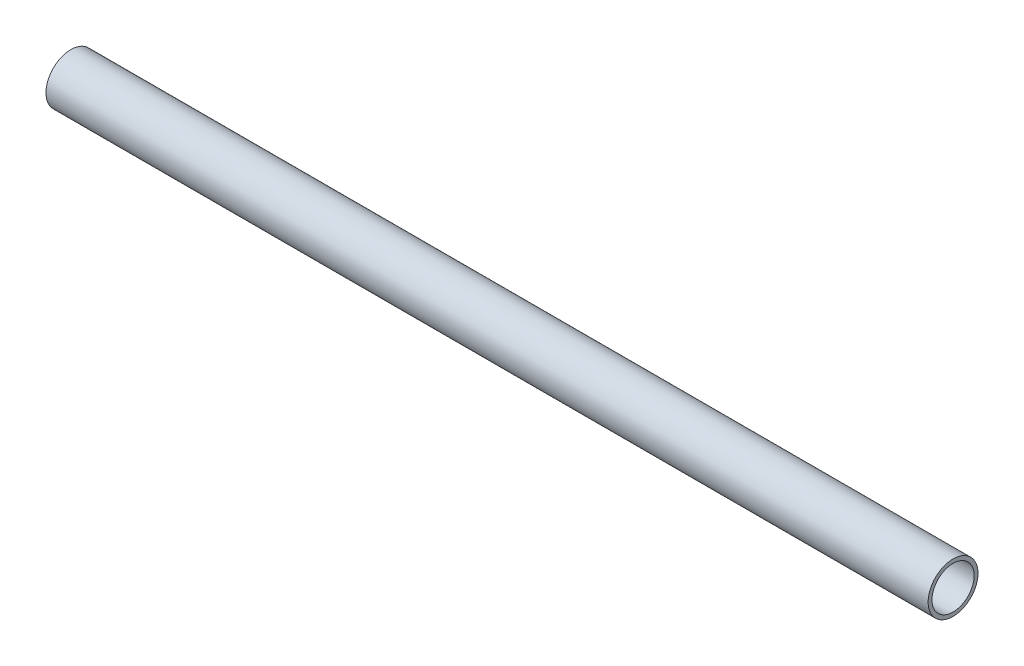
ISO-10303-21;
HEADER;
FILE_DESCRIPTION(('STEP AP214'),'2;1');
FILE_NAME('part.step','',(''),(''),'','','');
FILE_SCHEMA(('AUTOMOTIVE_DESIGN { 1 0 10303 214 1 1 1 1 }'));
ENDSEC;
DATA;
#1=APPLICATION_CONTEXT('core data for automotive mechanical design processes');
#2=APPLICATION_PROTOCOL_DEFINITION('international standard','automotive_design',2000,#1);
#3=PRODUCT_CONTEXT('',#1,'mechanical');
#4=PRODUCT('Part','Part','',(#3));
#5=PRODUCT_RELATED_PRODUCT_CATEGORY('part','',(#4));
#6=PRODUCT_DEFINITION_FORMATION('','',#4);
#7=PRODUCT_DEFINITION_CONTEXT('part definition',#1,'design');
#8=PRODUCT_DEFINITION('design','',#6,#7);
#9=PRODUCT_DEFINITION_SHAPE('','',#8);
#10=(LENGTH_UNIT() NAMED_UNIT(*) SI_UNIT(.MILLI.,.METRE.));
#11=(NAMED_UNIT(*) PLANE_ANGLE_UNIT() SI_UNIT($,.RADIAN.));
#12=(NAMED_UNIT(*) SI_UNIT($,.STERADIAN.) SOLID_ANGLE_UNIT());
#13=UNCERTAINTY_MEASURE_WITH_UNIT(LENGTH_MEASURE(1.E-05),#10,'distance_accuracy_value','');
#14=(GEOMETRIC_REPRESENTATION_CONTEXT(3) GLOBAL_UNCERTAINTY_ASSIGNED_CONTEXT((#13)) GLOBAL_UNIT_ASSIGNED_CONTEXT((#10,
#11,#12)) REPRESENTATION_CONTEXT('',''));
#15=CARTESIAN_POINT('',(0.,0.,0.));
#16=DIRECTION('',(0.,0.,1.));
#17=DIRECTION('',(1.,0.,0.));
#18=AXIS2_PLACEMENT_3D('',#15,#16,#17);
#19=CARTESIAN_POINT('',(460.,0.,0.));
#20=DIRECTION('',(1.,0.,0.));
#21=DIRECTION('',(0.,0.,-1.));
#22=AXIS2_PLACEMENT_3D('',#19,#20,#21);
#23=PLANE('',#22);
#24=CARTESIAN_POINT('',(460.,0.,0.));
#25=DIRECTION('',(1.,0.,0.));
#26=DIRECTION('',(0.,0.,-1.));
#27=AXIS2_PLACEMENT_3D('',#24,#25,#26);
#28=CIRCLE('',#27,13.);
#29=CARTESIAN_POINT('',(460.,0.,-13.));
#30=VERTEX_POINT('',#29);
#31=EDGE_CURVE('E10',#30,#30,#28,.T.);
#32=ORIENTED_EDGE('',*,*,#31,.T.);
#33=EDGE_LOOP('',(#32));
#34=FACE_BOUND('',#33,.T.);
#35=CARTESIAN_POINT('',(460.,0.,0.));
#36=DIRECTION('',(1.,0.,0.));
#37=DIRECTION('',(0.,0.,-1.));
#38=AXIS2_PLACEMENT_3D('',#35,#36,#37);
#39=CIRCLE('',#38,11.);
#40=CARTESIAN_POINT('',(460.,0.,-11.));
#41=VERTEX_POINT('',#40);
#42=EDGE_CURVE('E51',#41,#41,#39,.T.);
#43=ORIENTED_EDGE('',*,*,#42,.F.);
#44=EDGE_LOOP('',(#43));
#45=FACE_BOUND('',#44,.T.);
#46=ADVANCED_FACE('F33',(#34,#45),#23,.T.);
#47=CARTESIAN_POINT('',(0.,0.,0.));
#48=DIRECTION('',(1.,0.,0.));
#49=DIRECTION('',(0.,0.,-1.));
#50=AXIS2_PLACEMENT_3D('',#47,#48,#49);
#51=PLANE('',#50);
#52=CARTESIAN_POINT('',(0.,0.,0.));
#53=DIRECTION('',(1.,0.,0.));
#54=DIRECTION('',(0.,0.,-1.));
#55=AXIS2_PLACEMENT_3D('',#52,#53,#54);
#56=CIRCLE('',#55,13.);
#57=CARTESIAN_POINT('',(0.,0.,-13.));
#58=VERTEX_POINT('',#57);
#59=EDGE_CURVE('E46',#58,#58,#56,.T.);
#60=ORIENTED_EDGE('',*,*,#59,.F.);
#61=EDGE_LOOP('',(#60));
#62=FACE_BOUND('',#61,.T.);
#63=CARTESIAN_POINT('',(0.,0.,0.));
#64=DIRECTION('',(1.,0.,0.));
#65=DIRECTION('',(0.,0.,-1.));
#66=AXIS2_PLACEMENT_3D('',#63,#64,#65);
#67=CIRCLE('',#66,11.);
#68=CARTESIAN_POINT('',(0.,0.,-11.));
#69=VERTEX_POINT('',#68);
#70=EDGE_CURVE('E54',#69,#69,#67,.T.);
#71=ORIENTED_EDGE('',*,*,#70,.T.);
#72=EDGE_LOOP('',(#71));
#73=FACE_BOUND('',#72,.T.);
#74=ADVANCED_FACE('F86',(#62,#73),#51,.F.);
#75=CARTESIAN_POINT('',(460.,0.,0.));
#76=DIRECTION('',(-1.,0.,0.));
#77=DIRECTION('',(0.,0.,1.));
#78=AXIS2_PLACEMENT_3D('',#75,#76,#77);
#79=CYLINDRICAL_SURFACE('',#78,13.);
#80=CARTESIAN_POINT('',(447.5,0.,-13.));
#81=CARTESIAN_POINT('',(447.49999475878,0.139052660180755,-12.9999974610984));
#82=CARTESIAN_POINT('',(447.488359412702,0.27817277307216,-12.9977459806996));
#83=CARTESIAN_POINT('',(447.442158055138,0.552488133091366,-12.9889814495606));
#84=CARTESIAN_POINT('',(447.407573119314,0.6876800448946,-12.9824648818705));
#85=CARTESIAN_POINT('',(447.316574419512,0.950132537462374,-12.9658986493339));
#86=CARTESIAN_POINT('',(447.260180821726,1.07740031971374,-12.9558522492613));
#87=CARTESIAN_POINT('',(447.127223872074,1.32065723842359,-12.9333215487838));
#88=CARTESIAN_POINT('',(447.050661989214,1.43664719548843,-12.9208374259537));
#89=CARTESIAN_POINT('',(446.878520834292,1.65552432974221,-12.8946323002435));
#90=CARTESIAN_POINT('',(446.782737168549,1.75824929536754,-12.8808989548617));
#91=CARTESIAN_POINT('',(446.575310962805,1.94627668615618,-12.8538341361733));
#92=CARTESIAN_POINT('',(446.463667247923,2.03157781945353,-12.8405026927278));
#93=CARTESIAN_POINT('',(446.226536004642,2.18301679620622,-12.8156309401952));
#94=CARTESIAN_POINT('',(446.1009405689,2.24898851450227,-12.8041065326509));
#95=CARTESIAN_POINT('',(445.840190089973,2.35883220315189,-12.7843281256073));
#96=CARTESIAN_POINT('',(445.705035917458,2.4027061833528,-12.7760738286974));
#97=CARTESIAN_POINT('',(445.430743808281,2.46658610457139,-12.7638947012764));
#98=CARTESIAN_POINT('',(445.291674233303,2.48687558791543,-12.7599184822057));
#99=CARTESIAN_POINT('',(445.01205236308,2.50389090184763,-12.7565908775945));
#100=CARTESIAN_POINT('',(444.871500209056,2.50061895687195,-12.7572390554642));
#101=CARTESIAN_POINT('',(444.594964776838,2.47083395608556,-12.763040258418));
#102=CARTESIAN_POINT('',(444.458945155235,2.44464430650055,-12.7681305946622));
#103=CARTESIAN_POINT('',(444.193267016884,2.37027708135778,-12.7821440039021));
#104=CARTESIAN_POINT('',(444.063608783413,2.32209852760332,-12.7910672474073));
#105=CARTESIAN_POINT('',(443.81339305618,2.20480765459314,-12.8118060352358));
#106=CARTESIAN_POINT('',(443.692897889492,2.1355656559723,-12.8236394070727));
#107=CARTESIAN_POINT('',(443.465115028861,1.97820505089349,-12.848853471063));
#108=CARTESIAN_POINT('',(443.357828744408,1.89008443268648,-12.8622343280499));
#109=CARTESIAN_POINT('',(443.157641465779,1.6957289113267,-12.889308238097));
#110=CARTESIAN_POINT('',(443.065008809963,1.58921761155995,-12.9030027865394));
#111=CARTESIAN_POINT('',(442.898884492699,1.36202665615401,-12.9289572102898));
#112=CARTESIAN_POINT('',(442.825393042559,1.2413468441245,-12.9412170697587));
#113=CARTESIAN_POINT('',(442.69959395296,0.988957762488812,-12.9629474861032));
#114=CARTESIAN_POINT('',(442.647315265383,0.857233713043079,-12.9724142260635));
#115=CARTESIAN_POINT('',(442.565702576653,0.586650569197122,-12.9874624721642));
#116=CARTESIAN_POINT('',(442.536366009335,0.447792274642348,-12.993044412827));
#117=CARTESIAN_POINT('',(442.501846233846,0.16918991514463,-12.9996341283048));
#118=CARTESIAN_POINT('',(442.496295528159,0.0294929779953319,-13.0007114935454));
#119=CARTESIAN_POINT('',(442.508517777197,-0.248832636592813,-12.9983632998844));
#120=CARTESIAN_POINT('',(442.526289523902,-0.387461368986743,-12.994937974206));
#121=CARTESIAN_POINT('',(442.584346743995,-0.658542242580218,-12.9840126871957));
#122=CARTESIAN_POINT('',(442.624445278426,-0.79103590372499,-12.976546573136));
#123=CARTESIAN_POINT('',(442.725814780124,-1.04741955600189,-12.9583735448858));
#124=CARTESIAN_POINT('',(442.787087242297,-1.17130893891969,-12.9476664018813));
#125=CARTESIAN_POINT('',(442.929871743175,-1.40852868267245,-12.924025465347));
#126=CARTESIAN_POINT('',(443.011607091537,-1.52172218526331,-12.9110676225358));
#127=CARTESIAN_POINT('',(443.192696223497,-1.73291860543104,-12.8844225517876));
#128=CARTESIAN_POINT('',(443.292051743834,-1.83092002380894,-12.8707352520445));
#129=CARTESIAN_POINT('',(443.507228161396,-2.01035510164864,-12.8439416383922));
#130=CARTESIAN_POINT('',(443.623260250283,-2.09153739238514,-12.8308461515727));
#131=CARTESIAN_POINT('',(443.867530324273,-2.2332594883332,-12.8069410375943));
#132=CARTESIAN_POINT('',(443.995767841549,-2.29380008432375,-12.7961313228739));
#133=CARTESIAN_POINT('',(444.260186358946,-2.39216884187719,-12.7781075731774));
#134=CARTESIAN_POINT('',(444.396324133468,-2.43010977595279,-12.770875715852));
#135=CARTESIAN_POINT('',(444.673195073206,-2.48254790543447,-12.7607868732141));
#136=CARTESIAN_POINT('',(444.813927687707,-2.4970478999189,-12.7579293655635));
#137=CARTESIAN_POINT('',(445.093473355922,-2.5020951168735,-12.7569402050647));
#138=CARTESIAN_POINT('',(445.232279122967,-2.4930391021221,-12.7587302704385));
#139=CARTESIAN_POINT('',(445.506349944506,-2.45210266538043,-12.7666604796616));
#140=CARTESIAN_POINT('',(445.641615022809,-2.42022239691187,-12.7728005942514));
#141=CARTESIAN_POINT('',(445.904536619842,-2.334713477175,-12.7887053259627));
#142=CARTESIAN_POINT('',(446.032208295918,-2.28112994200391,-12.7984624206699));
#143=CARTESIAN_POINT('',(446.276812361891,-2.15377970785531,-12.8205066533974));
#144=CARTESIAN_POINT('',(446.393743938109,-2.08001148134922,-12.8327939828824));
#145=CARTESIAN_POINT('',(446.615531574685,-1.91301563814432,-12.8587559030273));
#146=CARTESIAN_POINT('',(446.720168681482,-1.81950009853849,-12.8724492796511));
#147=CARTESIAN_POINT('',(446.912397375494,-1.61626238485012,-12.8995420316146));
#148=CARTESIAN_POINT('',(446.999985042068,-1.50653649326078,-12.9129413387038));
#149=CARTESIAN_POINT('',(447.156413016856,-1.27273625734665,-12.9380865705891));
#150=CARTESIAN_POINT('',(447.225066370069,-1.14853493486942,-12.9498154901243));
#151=CARTESIAN_POINT('',(447.340420792364,-0.890172259350411,-12.9701319076699));
#152=CARTESIAN_POINT('',(447.387142167869,-0.756020253294867,-12.9787223099363));
#153=CARTESIAN_POINT('',(447.447984584215,-0.51792356570556,-12.9900734375022));
#154=CARTESIAN_POINT('',(447.467456489752,-0.415357439701686,-12.9937745900334));
#155=CARTESIAN_POINT('',(447.493465983637,-0.208540158514688,-12.9987387895389));
#156=CARTESIAN_POINT('',(447.500003930898,-0.104289050170329,-13.0000019041681));
#157=CARTESIAN_POINT('',(447.5,0.,-13.));
#158=B_SPLINE_CURVE_WITH_KNOTS('',3,(#80,#81,#82,#83,#84,#85,#86,#87,#88,#89,#90,#91,#92,#93,
#94,#95,#96,#97,#98,#99,#100,#101,#102,#103,#104,#105,#106,#107,#108,#109,#110,#111,#112,#113,
#114,#115,#116,#117,#118,#119,#120,#121,#122,#123,#124,#125,#126,#127,#128,#129,#130,#131,#132,
#133,#134,#135,#136,#137,#138,#139,#140,#141,#142,#143,#144,#145,#146,#147,#148,#149,#150,#151,
#152,#153,#154,#155,#156,#157),.UNSPECIFIED.,.T.,.F.,(4,2,2,2,2,2,2,2,2,2,2,2,2,2,2,2,2,2,2,2,2,
2,2,2,2,2,2,2,2,2,2,2,2,2,2,2,2,2,4),(0.,0.416776540572575,0.833897184796518,1.25063304157329,
1.66733855274582,2.08873532404097,2.51016332788527,2.93511361824242,3.36002525127149,
3.77977378984825,4.19948270045458,4.61336264699447,5.02726100716075,5.44376099870315,
5.86030539553688,6.28376393575659,6.70722715049961,7.13126639340051,7.55525819906336,
7.97267505699535,8.39007029508316,8.80402218494172,9.21800330627661,9.63671570954062,
10.0554694062925,10.4800902476651,10.904694820074,11.3271624654498,11.7495796603137,
12.1649281712355,12.5802738884446,12.99476059285,13.4092786732858,13.8303190431966,
14.2514561202699,14.676613602734,15.1013766593074,15.4139664054684,15.7265474772227),.UNSPECIFIED.);
#159=CARTESIAN_POINT('',(447.5,0.,-13.));
#160=VERTEX_POINT('',#159);
#161=EDGE_CURVE('E62',#160,#160,#158,.T.);
#162=ORIENTED_EDGE('',*,*,#161,.T.);
#163=EDGE_LOOP('',(#162));
#164=FACE_BOUND('',#163,.T.);
#165=CARTESIAN_POINT('',(23.,0.,-13.));
#166=CARTESIAN_POINT('',(22.9999954230033,0.111634129459772,-12.9999981798433));
#167=CARTESIAN_POINT('',(22.9906218073671,0.223332182929121,-12.9985470068655));
#168=CARTESIAN_POINT('',(22.9533858536235,0.443603799648008,-12.9928976712786));
#169=CARTESIAN_POINT('',(22.9255057350478,0.552174253226696,-12.9886968669639));
#170=CARTESIAN_POINT('',(22.8521115553316,0.762971221767027,-12.9780201450358));
#171=CARTESIAN_POINT('',(22.8066110666473,0.865202549429169,-12.9715459788835));
#172=CARTESIAN_POINT('',(22.6993014450486,1.06056417054209,-12.9570371396926));
#173=CARTESIAN_POINT('',(22.6374944879634,1.15369567594379,-12.9490026748879));
#174=CARTESIAN_POINT('',(22.49878654629,1.32899277202475,-12.9321924031196));
#175=CARTESIAN_POINT('',(22.4217781774524,1.41107292146211,-12.923411590907));
#176=CARTESIAN_POINT('',(22.2550844983716,1.56119998237499,-12.9061372591379));
#177=CARTESIAN_POINT('',(22.1653984442644,1.6292460698243,-12.8976437564756));
#178=CARTESIAN_POINT('',(21.9753182772141,1.7497082423405,-12.8818571696186));
#179=CARTESIAN_POINT('',(21.8748709307349,1.80204125030049,-12.874570554198));
#180=CARTESIAN_POINT('',(21.6664811209346,1.88906073325816,-12.8620913537326));
#181=CARTESIAN_POINT('',(21.5585390879946,1.92374822059573,-12.8568986485617));
#182=CARTESIAN_POINT('',(21.3391242090455,1.97422579132362,-12.8492445576298));
#183=CARTESIAN_POINT('',(21.2276858321148,1.99016243475776,-12.8467620000393));
#184=CARTESIAN_POINT('',(21.0036910700953,2.00314004931484,-12.8447450655813));
#185=CARTESIAN_POINT('',(20.8911347529015,2.00018216102486,-12.8452105107546));
#186=CARTESIAN_POINT('',(20.6691368963365,1.97557435962365,-12.8490176386625));
#187=CARTESIAN_POINT('',(20.5596767348901,1.9540879888833,-12.852334155509));
#188=CARTESIAN_POINT('',(20.3459339177356,1.89328929394482,-12.8614304087007));
#189=CARTESIAN_POINT('',(20.2416514155413,1.85397644155405,-12.8672102180321));
#190=CARTESIAN_POINT('',(20.040728302299,1.75847159016807,-12.8806094791762));
#191=CARTESIAN_POINT('',(19.944120994655,1.7022106216098,-12.8882364224677));
#192=CARTESIAN_POINT('',(19.7616562506645,1.57445566474822,-12.9044652207238));
#193=CARTESIAN_POINT('',(19.6757995565559,1.50296062558221,-12.9130671429243));
#194=CARTESIAN_POINT('',(19.5163256227573,1.3458707741095,-12.9303877351212));
#195=CARTESIAN_POINT('',(19.4428467859261,1.2601354172487,-12.939106680676));
#196=CARTESIAN_POINT('',(19.311299096169,1.07747683573123,-12.9555948808269));
#197=CARTESIAN_POINT('',(19.2532303172185,0.980553557370509,-12.9633641308639));
#198=CARTESIAN_POINT('',(19.1541427748092,0.778148209221874,-12.977086290908));
#199=CARTESIAN_POINT('',(19.1131350329157,0.672660659263364,-12.9830380261278));
#200=CARTESIAN_POINT('',(19.0494557432564,0.456184081690752,-12.992444828946));
#201=CARTESIAN_POINT('',(19.0267828908387,0.345195446112753,-12.9959000741847));
#202=CARTESIAN_POINT('',(19.0006018118208,0.122061413656298,-12.999900977609));
#203=CARTESIAN_POINT('',(18.9969033713341,0.00993883414831808,-13.000475512886));
#204=CARTESIAN_POINT('',(19.0082707196042,-0.213325058692731,-12.9987289757846));
#205=CARTESIAN_POINT('',(19.0233358963661,-0.324466403910715,-12.9964079978465));
#206=CARTESIAN_POINT('',(19.0716446506089,-0.542034248496511,-12.9891490837857));
#207=CARTESIAN_POINT('',(19.1047952239662,-0.64848188372896,-12.9842245404646));
#208=CARTESIAN_POINT('',(19.1882354343621,-0.854308287939675,-12.9723087739691));
#209=CARTESIAN_POINT('',(19.2385259121796,-0.953686709856466,-12.9653174494133));
#210=CARTESIAN_POINT('',(19.3552622667865,-1.14338785915144,-12.9499729976666));
#211=CARTESIAN_POINT('',(19.4218283957551,-1.23363576499287,-12.94160989393));
#212=CARTESIAN_POINT('',(19.5690595094191,-1.40174739518524,-12.9244828841827));
#213=CARTESIAN_POINT('',(19.6497253584679,-1.47961035974429,-12.9157189536244));
#214=CARTESIAN_POINT('',(19.8237143309493,-1.62143687177062,-12.8986860695372));
#215=CARTESIAN_POINT('',(19.9171421440541,-1.68527268254131,-12.8904221246483));
#216=CARTESIAN_POINT('',(20.1135063764516,-1.79634400375255,-12.8754146609527));
#217=CARTESIAN_POINT('',(20.2164425283813,-1.84357998078108,-12.8686710994129));
#218=CARTESIAN_POINT('',(20.4285258349847,-1.91991433220861,-12.8575044908204));
#219=CARTESIAN_POINT('',(20.5376486198415,-1.94907911782486,-12.8530729567255));
#220=CARTESIAN_POINT('',(20.7593170122032,-1.98865407244709,-12.8470098709954));
#221=CARTESIAN_POINT('',(20.871862369325,-1.99906561003298,-12.8453781150375));
#222=CARTESIAN_POINT('',(21.0959074702455,-2.00080471457037,-12.8451072329882));
#223=CARTESIAN_POINT('',(21.2074056683351,-1.99233317092469,-12.8464366045642));
#224=CARTESIAN_POINT('',(21.4273712100541,-1.95697794807654,-12.8518695985565));
#225=CARTESIAN_POINT('',(21.5358385595688,-1.93009430462956,-12.8559732155853));
#226=CARTESIAN_POINT('',(21.7466028412376,-1.8587503820862,-12.8664810988442));
#227=CARTESIAN_POINT('',(21.8489048745791,-1.81430487035791,-12.8728834317255));
#228=CARTESIAN_POINT('',(22.0446326689811,-1.7091189717658,-12.8872696044034));
#229=CARTESIAN_POINT('',(22.13805809795,-1.64837797557981,-12.8952535033351));
#230=CARTESIAN_POINT('',(22.3144000971441,-1.51159830040354,-12.9120041996598));
#231=CARTESIAN_POINT('',(22.3972007639687,-1.43541104590757,-12.9207781015993));
#232=CARTESIAN_POINT('',(22.5489127619627,-1.27021551598636,-12.9380614876198));
#233=CARTESIAN_POINT('',(22.6178208662629,-1.18120427010545,-12.9465709098818));
#234=CARTESIAN_POINT('',(22.7401512141118,-0.992277722296826,-12.9624232087798));
#235=CARTESIAN_POINT('',(22.7934812033924,-0.892302099536093,-12.9697590240101));
#236=CARTESIAN_POINT('',(22.8825114634284,-0.684745126818872,-12.9823684829832));
#237=CARTESIAN_POINT('',(22.918229838641,-0.577171717906743,-12.9876442432633));
#238=CARTESIAN_POINT('',(22.9629971374694,-0.390941400069085,-12.9943465728122));
#239=CARTESIAN_POINT('',(22.97685178146,-0.313429175326517,-12.9964556222015));
#240=CARTESIAN_POINT('',(22.9953547635069,-0.157288536394366,-12.9992829677305));
#241=CARTESIAN_POINT('',(23.0000032250638,-0.0786601371924729,-13.0000012825269));
#242=CARTESIAN_POINT('',(23.,0.,-13.));
#243=B_SPLINE_CURVE_WITH_KNOTS('',3,(#165,#166,#167,#168,#169,#170,#171,#172,#173,#174,#175,
#176,#177,#178,#179,#180,#181,#182,#183,#184,#185,#186,#187,#188,#189,#190,#191,#192,#193,#194,
#195,#196,#197,#198,#199,#200,#201,#202,#203,#204,#205,#206,#207,#208,#209,#210,#211,#212,#213,
#214,#215,#216,#217,#218,#219,#220,#221,#222,#223,#224,#225,#226,#227,#228,#229,#230,#231,#232,
#233,#234,#235,#236,#237,#238,#239,#240,#241,#242),.UNSPECIFIED.,.T.,.F.,(4,2,2,2,2,2,2,2,2,2,2,
2,2,2,2,2,2,2,2,2,2,2,2,2,2,2,2,2,2,2,2,2,2,2,2,2,2,2,4),(0.,0.334614935402755,
0.669551824578953,1.00423123317536,1.33886600689116,1.67595520660421,2.0130641932687,
2.35192534458354,2.69076705292646,3.02694233717947,3.36309732807123,3.69631525463016,
4.02954305496923,4.36414566185346,4.69877135746455,5.03692069824303,5.37507166226689,
5.71344073657472,6.05178573150938,6.38673217834279,6.72166770083348,7.05489683473247,
7.38814231716765,7.72392860544464,8.05973548561447,8.39848409534482,8.73722318277052,
9.07470991155935,9.41217201014686,9.74606114027123,10.0799496219993,10.4135579400877,
10.7471787342265,11.0841753844584,11.4212502200089,11.7602825362116,12.0989656022034,
12.3347466304,12.5705244955816),.UNSPECIFIED.);
#244=CARTESIAN_POINT('',(23.,0.,-13.));
#245=VERTEX_POINT('',#244);
#246=EDGE_CURVE('E61',#245,#245,#243,.T.);
#247=ORIENTED_EDGE('',*,*,#246,.T.);
#248=EDGE_LOOP('',(#247));
#249=FACE_BOUND('',#248,.T.);
#250=ORIENTED_EDGE('',*,*,#31,.F.);
#251=EDGE_LOOP('',(#250));
#252=FACE_BOUND('',#251,.T.);
#253=ORIENTED_EDGE('',*,*,#59,.T.);
#254=EDGE_LOOP('',(#253));
#255=FACE_BOUND('',#254,.T.);
#256=ADVANCED_FACE('F35',(#164,#249,#252,#255),#79,.T.);
#257=CARTESIAN_POINT('',(460.,0.,0.));
#258=DIRECTION('',(-1.,0.,0.));
#259=DIRECTION('',(0.,0.,1.));
#260=AXIS2_PLACEMENT_3D('',#257,#258,#259);
#261=CYLINDRICAL_SURFACE('',#260,11.);
#262=CARTESIAN_POINT('',(447.5,0.,-11.));
#263=CARTESIAN_POINT('',(447.499995468174,0.138518278596906,-10.9999974735185));
#264=CARTESIAN_POINT('',(447.488448772423,0.277090172258011,-10.9973570934613));
#265=CARTESIAN_POINT('',(447.442620523938,0.550288594599326,-10.987079320306));
#266=CARTESIAN_POINT('',(447.408323604045,0.684912392220731,-10.9794385496265));
#267=CARTESIAN_POINT('',(447.318131951368,0.946227671984925,-10.9600095312294));
#268=CARTESIAN_POINT('',(447.262260672019,1.07292759495649,-10.9482257885674));
#269=CARTESIAN_POINT('',(447.130582886619,1.31515227582568,-10.921778201627));
#270=CARTESIAN_POINT('',(447.054776579158,1.43067714503183,-10.9071143860398));
#271=CARTESIAN_POINT('',(446.883997955393,1.64926760444638,-10.8762265816814));
#272=CARTESIAN_POINT('',(446.788747426525,1.75211293892049,-10.8599819758326));
#273=CARTESIAN_POINT('',(446.582381025863,1.94051389816611,-10.827906511833));
#274=CARTESIAN_POINT('',(446.471263649306,2.02606788121785,-10.8120756930933));
#275=CARTESIAN_POINT('',(446.234667944716,2.17844599401788,-10.7824158369221));
#276=CARTESIAN_POINT('',(446.109033003694,2.24503254356576,-10.7686131580577));
#277=CARTESIAN_POINT('',(445.847990499418,2.35606069717871,-10.7448696147509));
#278=CARTESIAN_POINT('',(445.712584207938,2.40050517717751,-10.7349282488168));
#279=CARTESIAN_POINT('',(445.438240812883,2.4652534941272,-10.7202434469831));
#280=CARTESIAN_POINT('',(445.299400736877,2.48594892680756,-10.715415797339));
#281=CARTESIAN_POINT('',(445.020141772787,2.50382988451489,-10.7112523406768));
#282=CARTESIAN_POINT('',(444.879723097338,2.50101853886554,-10.711915802658));
#283=CARTESIAN_POINT('',(444.604227116651,2.47228016958764,-10.7185835035919));
#284=CARTESIAN_POINT('',(444.469099093805,2.44681104599439,-10.7244819412976));
#285=CARTESIAN_POINT('',(444.205085513845,2.37420684920503,-10.7407873672743));
#286=CARTESIAN_POINT('',(444.076200332373,2.3270704740429,-10.7511946264744));
#287=CARTESIAN_POINT('',(443.827059328189,2.21205734402548,-10.7754474384537));
#288=CARTESIAN_POINT('',(443.706886482236,2.14400712086012,-10.7893215597825));
#289=CARTESIAN_POINT('',(443.479497446889,1.98921977920413,-10.8189276843241));
#290=CARTESIAN_POINT('',(443.372283159736,1.9024799223714,-10.8346599596346));
#291=CARTESIAN_POINT('',(443.171221438179,1.71036518003521,-10.8666615287251));
#292=CARTESIAN_POINT('',(443.077745573484,1.60460166742831,-10.882934773515));
#293=CARTESIAN_POINT('',(442.909794111293,1.37871229840976,-10.9138502597158));
#294=CARTESIAN_POINT('',(442.835318913301,1.25858614009084,-10.9284924668293));
#295=CARTESIAN_POINT('',(442.707379612028,1.00690799179919,-10.9545497424637));
#296=CARTESIAN_POINT('',(442.653967226378,0.875328834348185,-10.9659568484873));
#297=CARTESIAN_POINT('',(442.570115994132,0.604745122491714,-10.9841998956698));
#298=CARTESIAN_POINT('',(442.539673534178,0.465741739663735,-10.9910365557784));
#299=CARTESIAN_POINT('',(442.503173762527,0.187439840192746,-10.9992650071756));
#300=CARTESIAN_POINT('',(442.496609308683,0.0482110923370514,-11.0007700184113));
#301=CARTESIAN_POINT('',(442.506673039853,-0.229353886680091,-10.9984842255063));
#302=CARTESIAN_POINT('',(442.523299519406,-0.367690182720846,-10.9946938107912));
#303=CARTESIAN_POINT('',(442.578853166905,-0.637841677218445,-10.9823148103741));
#304=CARTESIAN_POINT('',(442.617511546444,-0.76971503681441,-10.973784087055));
#305=CARTESIAN_POINT('',(442.715731027457,-1.02510393087759,-10.9528806132367));
#306=CARTESIAN_POINT('',(442.775294004253,-1.14861871432288,-10.9405075180554));
#307=CARTESIAN_POINT('',(442.914669143555,-1.38586085256054,-10.9130143275095));
#308=CARTESIAN_POINT('',(442.994775626773,-1.49941068522717,-10.8978552985532));
#309=CARTESIAN_POINT('',(443.17257932844,-1.7116377357905,-10.866546095646));
#310=CARTESIAN_POINT('',(443.270279026547,-1.81031285357969,-10.8503957821912));
#311=CARTESIAN_POINT('',(443.482830965133,-1.99201706218097,-10.8185287714487));
#312=CARTESIAN_POINT('',(443.597987241787,-2.07469366594063,-10.8028272119253));
#313=CARTESIAN_POINT('',(443.84084639067,-2.21953814406555,-10.7740023321604));
#314=CARTESIAN_POINT('',(443.96854870796,-2.28170692501019,-10.7608788979592));
#315=CARTESIAN_POINT('',(444.232180469569,-2.38333597241931,-10.7388274870674));
#316=CARTESIAN_POINT('',(444.368057323743,-2.42292716221709,-10.7298753781702));
#317=CARTESIAN_POINT('',(444.644766906699,-2.47865258340368,-10.7171411058581));
#318=CARTESIAN_POINT('',(444.785598765136,-2.49479091341616,-10.7133580391079));
#319=CARTESIAN_POINT('',(445.064658619311,-2.50296739214167,-10.7114502943222));
#320=CARTESIAN_POINT('',(445.202869599334,-2.49556548501073,-10.7131941458177));
#321=CARTESIAN_POINT('',(445.476018910188,-2.45813115403285,-10.7218446846914));
#322=CARTESIAN_POINT('',(445.61095728611,-2.42809904217011,-10.7287513008948));
#323=CARTESIAN_POINT('',(445.873243397366,-2.34653692360611,-10.7468826027048));
#324=CARTESIAN_POINT('',(446.000619691142,-2.29509457527997,-10.758089666867));
#325=CARTESIAN_POINT('',(446.245014706901,-2.17224536606883,-10.783564723281));
#326=CARTESIAN_POINT('',(446.362032250326,-2.10083623731226,-10.7978330631966));
#327=CARTESIAN_POINT('',(446.585134427655,-1.93824996891051,-10.828211072634));
#328=CARTESIAN_POINT('',(446.690925722207,-1.84667645642835,-10.8443540558786));
#329=CARTESIAN_POINT('',(446.885823185082,-1.64715628932418,-10.8764454859305));
#330=CARTESIAN_POINT('',(446.974925470966,-1.53920583540677,-10.8923938866665));
#331=CARTESIAN_POINT('',(447.135138060234,-1.3081406051506,-10.9225693389041));
#332=CARTESIAN_POINT('',(447.205973823333,-1.18483162187623,-10.9367686161711));
#333=CARTESIAN_POINT('',(447.325799970663,-0.927755967711714,-10.9615640551399));
#334=CARTESIAN_POINT('',(447.374807994787,-0.793997844337712,-10.9721631246672));
#335=CARTESIAN_POINT('',(447.441227906176,-0.550163071539627,-10.9867559512784));
#336=CARTESIAN_POINT('',(447.463223987689,-0.441368111138492,-10.9916908558499));
#337=CARTESIAN_POINT('',(447.492611473579,-0.221726814930917,-10.9983138080738));
#338=CARTESIAN_POINT('',(447.500003627619,-0.110880584717101,-11.0000020223883));
#339=CARTESIAN_POINT('',(447.5,0.,-11.));
#340=B_SPLINE_CURVE_WITH_KNOTS('',3,(#262,#263,#264,#265,#266,#267,#268,#269,#270,#271,#272,
#273,#274,#275,#276,#277,#278,#279,#280,#281,#282,#283,#284,#285,#286,#287,#288,#289,#290,#291,
#292,#293,#294,#295,#296,#297,#298,#299,#300,#301,#302,#303,#304,#305,#306,#307,#308,#309,#310,
#311,#312,#313,#314,#315,#316,#317,#318,#319,#320,#321,#322,#323,#324,#325,#326,#327,#328,#329,
#330,#331,#332,#333,#334,#335,#336,#337,#338,#339),.UNSPECIFIED.,.T.,.F.,(4,2,2,2,2,2,2,2,2,2,2,
2,2,2,2,2,2,2,2,2,2,2,2,2,2,2,2,2,2,2,2,2,2,2,2,2,2,2,4),(0.,0.415148849633319,
0.830578406996924,1.2455576175532,1.66053269430527,2.08192389396808,2.50335508365801,
2.92985362973414,3.35629676538242,3.77560244898083,4.19485231368764,4.60581714174245,
5.01680666753972,5.43130157438848,5.84585725297981,6.27011531803709,6.69438230269867,
7.11968464096652,7.54492006169902,7.96106941916768,8.37718817463633,8.78833576149042,
9.19952024123089,9.61696129328771,10.0344612272568,10.460313215404,10.8861463755949,
11.3094844190901,11.7327484710941,12.1460204395147,12.5592867105955,12.9708773657616,
13.3825147893181,13.8031102578593,14.2238034502008,14.6504927745348,15.0768366452217,
15.4091704772437,15.7414872491402),.UNSPECIFIED.);
#341=CARTESIAN_POINT('',(447.5,0.,-11.));
#342=VERTEX_POINT('',#341);
#343=EDGE_CURVE('E38',#342,#342,#340,.T.);
#344=ORIENTED_EDGE('',*,*,#343,.F.);
#345=EDGE_LOOP('',(#344));
#346=FACE_BOUND('',#345,.T.);
#347=CARTESIAN_POINT('',(23.,0.,-11.));
#348=CARTESIAN_POINT('',(22.9999956813393,0.111357271644373,-10.9999980072786));
#349=CARTESIAN_POINT('',(22.9906682425173,0.222771449918202,-10.9982915273343));
#350=CARTESIAN_POINT('',(22.9536265339751,0.442464406848309,-10.99164847502));
#351=CARTESIAN_POINT('',(22.9258963514186,0.550740387266074,-10.9867091072254));
#352=CARTESIAN_POINT('',(22.852922870329,0.760947572513748,-10.9741532323507));
#353=CARTESIAN_POINT('',(22.8076949678102,0.862884263930177,-10.9665390793192));
#354=CARTESIAN_POINT('',(22.7010526688082,1.0577120033845,-10.949466714983));
#355=CARTESIAN_POINT('',(22.6396397348118,1.15060386767905,-10.9400086703132));
#356=CARTESIAN_POINT('',(22.5016340903573,1.32576444051238,-10.9201743349983));
#357=CARTESIAN_POINT('',(22.4248941580192,1.40791622603346,-10.9097897259708));
#358=CARTESIAN_POINT('',(22.2587296459102,1.55825357341079,-10.8893349521181));
#359=CARTESIAN_POINT('',(22.1693041883109,1.62643816794977,-10.8792648091126));
#360=CARTESIAN_POINT('',(21.9794872705402,1.74738695016477,-10.8604984020977));
#361=CARTESIAN_POINT('',(21.8790194647696,1.80003313265556,-10.851812871101));
#362=CARTESIAN_POINT('',(21.670481349676,1.88765546949979,-10.836915832769));
#363=CARTESIAN_POINT('',(21.562411655975,1.92263305283275,-10.8307041253674));
#364=CARTESIAN_POINT('',(21.3429853506434,1.97355197711315,-10.8215415351671));
#365=CARTESIAN_POINT('',(21.2316774082904,1.98969666425445,-10.8185558462234));
#366=CARTESIAN_POINT('',(21.0078955926854,2.00312248736689,-10.8160783143231));
#367=CARTESIAN_POINT('',(20.895421818484,2.00040521296643,-10.8165861769405));
#368=CARTESIAN_POINT('',(20.673968085867,1.97634934427,-10.8210066504918));
#369=CARTESIAN_POINT('',(20.5649621321043,1.95524117699073,-10.8248771281426));
#370=CARTESIAN_POINT('',(20.3520649816328,1.89536523340027,-10.8355206127391));
#371=CARTESIAN_POINT('',(20.2481739906482,1.85659674743189,-10.8422937363232));
#372=CARTESIAN_POINT('',(20.0477772092213,1.76227297789296,-10.8580238155272));
#373=CARTESIAN_POINT('',(19.9513165573339,1.7066239037154,-10.8669929171435));
#374=CARTESIAN_POINT('',(19.7690152630547,1.58018503374043,-10.8860962201172));
#375=CARTESIAN_POINT('',(19.6831756373538,1.50939379023585,-10.8962305328347));
#376=CARTESIAN_POINT('',(19.5232210035556,1.35343399418352,-10.9167064080854));
#377=CARTESIAN_POINT('',(19.4492983115631,1.2680681726569,-10.9270488181647));
#378=CARTESIAN_POINT('',(19.3167948665192,1.08604454069331,-10.9466375043709));
#379=CARTESIAN_POINT('',(19.2582142503787,0.989386629498159,-10.9558837707156));
#380=CARTESIAN_POINT('',(19.158032610215,0.787327598497298,-10.9722553782534));
#381=CARTESIAN_POINT('',(19.116450731304,0.681916780395493,-10.9793783255922));
#382=CARTESIAN_POINT('',(19.0516368075063,0.465448414462667,-10.9906820547088));
#383=CARTESIAN_POINT('',(19.0284029314261,0.354391431316066,-10.994863130091));
#384=CARTESIAN_POINT('',(19.0012102380809,0.1314386495785,-10.9997719337866));
#385=CARTESIAN_POINT('',(18.9969877765459,0.0195760121089346,-11.0005468934114));
#386=CARTESIAN_POINT('',(19.0072317981815,-0.203257238970967,-10.998686302475));
#387=CARTESIAN_POINT('',(19.0216974200717,-0.314227893453082,-10.9960509090871));
#388=CARTESIAN_POINT('',(19.0686877495619,-0.531297097592758,-10.9876950863245));
#389=CARTESIAN_POINT('',(19.1010798691828,-0.637425297458318,-10.9819973157216));
#390=CARTESIAN_POINT('',(19.1828608285219,-0.842744713756611,-10.9681529512222));
#391=CARTESIAN_POINT('',(19.2322507676977,-0.941935480960949,-10.9600061989244));
#392=CARTESIAN_POINT('',(19.3472146378029,-1.13169524707494,-10.9420497958484));
#393=CARTESIAN_POINT('',(19.4129506871559,-1.22216445208488,-10.932223816146));
#394=CARTESIAN_POINT('',(19.5585203766711,-1.39088213822348,-10.9120428807109));
#395=CARTESIAN_POINT('',(19.6383552494119,-1.46912954974332,-10.901687878785));
#396=CARTESIAN_POINT('',(19.8110468814485,-1.6121773788768,-10.8814603955764));
#397=CARTESIAN_POINT('',(19.9040533065259,-1.67679836741419,-10.8715955212189));
#398=CARTESIAN_POINT('',(20.0997561814065,-1.78949986552014,-10.8536151008102));
#399=CARTESIAN_POINT('',(20.2024522846844,-1.83758096630795,-10.8454994922354));
#400=CARTESIAN_POINT('',(20.4141507496917,-1.91557945241747,-10.8319954461548));
#401=CARTESIAN_POINT('',(20.5231212307381,-1.9455810786184,-10.8265943801675));
#402=CARTESIAN_POINT('',(20.7446629886311,-1.98683040178554,-10.8191012654539));
#403=CARTESIAN_POINT('',(20.8572338848489,-1.99808007453629,-10.8170088681136));
#404=CARTESIAN_POINT('',(21.0809853754636,-2.00144313663184,-10.8163869388262));
#405=CARTESIAN_POINT('',(21.1921616714385,-1.99383937001233,-10.8178047454411));
#406=CARTESIAN_POINT('',(21.4116236380174,-1.96032846912815,-10.8239270874703));
#407=CARTESIAN_POINT('',(21.5199093234943,-1.93442142905718,-10.8286316059701));
#408=CARTESIAN_POINT('',(21.7303761973954,-1.86515567158477,-10.8407757208091));
#409=CARTESIAN_POINT('',(21.8325671602234,-1.82182581019232,-10.8482107929975));
#410=CARTESIAN_POINT('',(22.0282744471647,-1.71897473664823,-10.8649817751485));
#411=CARTESIAN_POINT('',(22.1217902088456,-1.65945247569007,-10.8743178082294));
#412=CARTESIAN_POINT('',(22.2989128745956,-1.52491543662799,-10.8940032465147));
#413=CARTESIAN_POINT('',(22.3823615698708,-1.449694155531,-10.9043650783111));
#414=CARTESIAN_POINT('',(22.5355470810122,-1.28632651423364,-10.9248399206865));
#415=CARTESIAN_POINT('',(22.6052807403922,-1.19817718680093,-10.9349528735192));
#416=CARTESIAN_POINT('',(22.7296002971235,-1.0105711896463,-10.9538897429719));
#417=CARTESIAN_POINT('',(22.7840541851801,-0.911025849790498,-10.9627021317343));
#418=CARTESIAN_POINT('',(22.8753792160741,-0.704073905086346,-10.9779326099335));
#419=CARTESIAN_POINT('',(22.9122671592783,-0.596674925486671,-10.9843529858473));
#420=CARTESIAN_POINT('',(22.9597754303022,-0.407441749458407,-10.9927407037649));
#421=CARTESIAN_POINT('',(22.9748343329604,-0.326725427276491,-10.9954478027358));
#422=CARTESIAN_POINT('',(22.9949480937949,-0.164016342132204,-10.9990781643304));
#423=CARTESIAN_POINT('',(23.0000031810418,-0.0820236084408334,-11.0000014678));
#424=CARTESIAN_POINT('',(23.,0.,-11.));
#425=B_SPLINE_CURVE_WITH_KNOTS('',3,(#347,#348,#349,#350,#351,#352,#353,#354,#355,#356,#357,
#358,#359,#360,#361,#362,#363,#364,#365,#366,#367,#368,#369,#370,#371,#372,#373,#374,#375,#376,
#377,#378,#379,#380,#381,#382,#383,#384,#385,#386,#387,#388,#389,#390,#391,#392,#393,#394,#395,
#396,#397,#398,#399,#400,#401,#402,#403,#404,#405,#406,#407,#408,#409,#410,#411,#412,#413,#414,
#415,#416,#417,#418,#419,#420,#421,#422,#423,#424),.UNSPECIFIED.,.T.,.F.,(4,2,2,2,2,2,2,2,2,2,2,
2,2,2,2,2,2,2,2,2,2,2,2,2,2,2,2,2,2,2,2,2,2,2,2,2,2,2,4),(0.,0.333771891552332,0.66783277207259,
1.00160038286675,1.3353378446015,1.67245014596885,2.00958578663078,2.3492195220365,
2.68882578455731,3.02473021172645,3.36060633024203,3.69233367290895,4.02407434678871,
4.35769306461626,4.69134369321256,5.02993210441872,5.36852353704647,5.70749527023812,
6.04643316861454,6.38065600997365,6.71486344850798,7.04663143285431,7.37842088074222,
7.71364226795667,8.04889297616124,8.3883150613046,8.72772501252476,9.06554101076158,
9.40332141303603,9.73606509730372,10.0688070691931,10.4010002025896,10.7332148577691,
11.0701111453004,11.4070848782946,11.7468860454293,12.0863615649817,12.3322171022956,
12.5780670098677),.UNSPECIFIED.);
#426=CARTESIAN_POINT('',(23.,0.,-11.));
#427=VERTEX_POINT('',#426);
#428=EDGE_CURVE('E56',#427,#427,#425,.T.);
#429=ORIENTED_EDGE('',*,*,#428,.F.);
#430=EDGE_LOOP('',(#429));
#431=FACE_BOUND('',#430,.T.);
#432=ORIENTED_EDGE('',*,*,#42,.T.);
#433=EDGE_LOOP('',(#432));
#434=FACE_BOUND('',#433,.T.);
#435=ORIENTED_EDGE('',*,*,#70,.F.);
#436=EDGE_LOOP('',(#435));
#437=FACE_BOUND('',#436,.T.);
#438=ADVANCED_FACE('F63',(#346,#431,#434,#437),#261,.F.);
#439=CARTESIAN_POINT('',(21.,0.,-13.));
#440=DIRECTION('',(0.,0.,1.));
#441=DIRECTION('',(1.,0.,0.));
#442=AXIS2_PLACEMENT_3D('',#439,#440,#441);
#443=CYLINDRICAL_SURFACE('',#442,2.);
#444=ORIENTED_EDGE('',*,*,#428,.T.);
#445=EDGE_LOOP('',(#444));
#446=FACE_BOUND('',#445,.T.);
#447=ORIENTED_EDGE('',*,*,#246,.F.);
#448=EDGE_LOOP('',(#447));
#449=FACE_BOUND('',#448,.T.);
#450=ADVANCED_FACE('F66',(#446,#449),#443,.F.);
#451=CARTESIAN_POINT('',(445.,0.,-13.));
#452=DIRECTION('',(0.,0.,1.));
#453=DIRECTION('',(1.,0.,0.));
#454=AXIS2_PLACEMENT_3D('',#451,#452,#453);
#455=CYLINDRICAL_SURFACE('',#454,2.50000000000002);
#456=ORIENTED_EDGE('',*,*,#343,.T.);
#457=EDGE_LOOP('',(#456));
#458=FACE_BOUND('',#457,.T.);
#459=ORIENTED_EDGE('',*,*,#161,.F.);
#460=EDGE_LOOP('',(#459));
#461=FACE_BOUND('',#460,.T.);
#462=ADVANCED_FACE('F69',(#458,#461),#455,.F.);
#463=CLOSED_SHELL('',(#46,#74,#256,#438,#450,#462));
#464=MANIFOLD_SOLID_BREP('B2',#463);
#465=ADVANCED_BREP_SHAPE_REPRESENTATION('',(#18,#464),#14);
#466=SHAPE_DEFINITION_REPRESENTATION(#9,#465);
ENDSEC;
END-ISO-10303-21;
